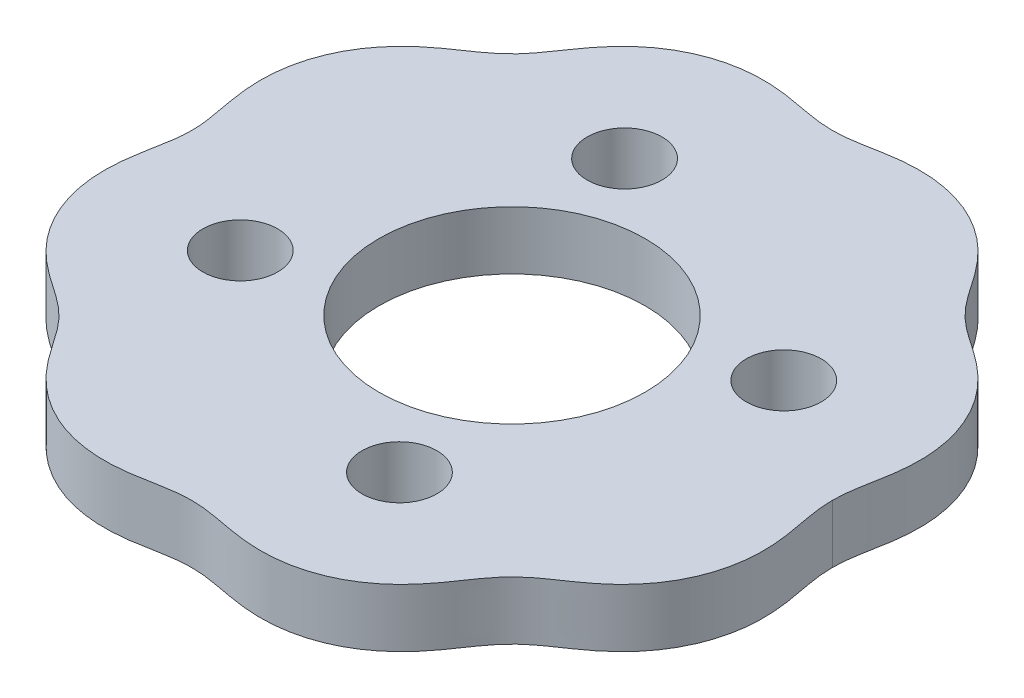
ISO-10303-21;
HEADER;
FILE_DESCRIPTION(('STEP AP214'),'2;1');
FILE_NAME('part.step','',(''),(''),'','','');
FILE_SCHEMA(('AUTOMOTIVE_DESIGN { 1 0 10303 214 1 1 1 1 }'));
ENDSEC;
DATA;
#1=APPLICATION_CONTEXT('core data for automotive mechanical design processes');
#2=APPLICATION_PROTOCOL_DEFINITION('international standard','automotive_design',2000,#1);
#3=PRODUCT_CONTEXT('',#1,'mechanical');
#4=PRODUCT('Part','Part','',(#3));
#5=PRODUCT_RELATED_PRODUCT_CATEGORY('part','',(#4));
#6=PRODUCT_DEFINITION_FORMATION('','',#4);
#7=PRODUCT_DEFINITION_CONTEXT('part definition',#1,'design');
#8=PRODUCT_DEFINITION('design','',#6,#7);
#9=PRODUCT_DEFINITION_SHAPE('','',#8);
#10=(LENGTH_UNIT() NAMED_UNIT(*) SI_UNIT(.MILLI.,.METRE.));
#11=(NAMED_UNIT(*) PLANE_ANGLE_UNIT() SI_UNIT($,.RADIAN.));
#12=(NAMED_UNIT(*) SI_UNIT($,.STERADIAN.) SOLID_ANGLE_UNIT());
#13=UNCERTAINTY_MEASURE_WITH_UNIT(LENGTH_MEASURE(1.E-05),#10,'distance_accuracy_value','');
#14=(GEOMETRIC_REPRESENTATION_CONTEXT(3) GLOBAL_UNCERTAINTY_ASSIGNED_CONTEXT((#13)) GLOBAL_UNIT_ASSIGNED_CONTEXT((#10,
#11,#12)) REPRESENTATION_CONTEXT('',''));
#15=CARTESIAN_POINT('',(0.,0.,0.));
#16=DIRECTION('',(0.,0.,1.));
#17=DIRECTION('',(1.,0.,0.));
#18=AXIS2_PLACEMENT_3D('',#15,#16,#17);
#19=CARTESIAN_POINT('',(38.5000019324491,7.,1.14099471515937E-11));
#20=CARTESIAN_POINT('',(38.4999949302389,7.,0.133038025414113));
#21=CARTESIAN_POINT('',(38.5043031681863,7.,0.465241084259243));
#22=CARTESIAN_POINT('',(38.5285272126738,7.,0.995915147057725));
#23=CARTESIAN_POINT('',(38.5972990036719,7.,1.72358155813141));
#24=CARTESIAN_POINT('',(38.7139543733227,7.,2.55647340188548));
#25=CARTESIAN_POINT('',(38.8656402849835,7.,3.42900023170654));
#26=CARTESIAN_POINT('',(39.0391822681178,7.,4.34247613603289));
#27=CARTESIAN_POINT('',(39.2165693288508,7.,5.30060109655928));
#28=CARTESIAN_POINT('',(39.3735068493325,7.,6.26232921880353));
#29=CARTESIAN_POINT('',(39.4980723718757,7.,7.22893747483395));
#30=CARTESIAN_POINT('',(39.6026794154683,7.,8.4427814490737));
#31=CARTESIAN_POINT('',(39.6384010851292,7.,10.0804988632723));
#32=CARTESIAN_POINT('',(39.4713431710599,7.,12.1348703910712));
#33=CARTESIAN_POINT('',(38.9177233658717,7.,14.5566631148558));
#34=CARTESIAN_POINT('',(37.9168742012955,7.,17.021348244654));
#35=CARTESIAN_POINT('',(36.6318803275373,7.,19.132177597851));
#36=CARTESIAN_POINT('',(35.1812554593009,7.,20.8901682691501));
#37=CARTESIAN_POINT('',(33.6686410116918,7.,22.3296155023299));
#38=CARTESIAN_POINT('',(32.1774646795737,7.,23.5049182739017));
#39=CARTESIAN_POINT('',(30.6767757172432,7.,24.536372270076));
#40=CARTESIAN_POINT('',(29.230318996941,7.,25.5119313646092));
#41=CARTESIAN_POINT('',(27.9082008530609,7.,26.5341513255084));
#42=CARTESIAN_POINT('',(26.7634346900469,7.,27.6480788865837));
#43=CARTESIAN_POINT('',(25.7050450653617,7.,28.9579021705699));
#44=CARTESIAN_POINT('',(24.7072609322575,7.,30.4189540053425));
#45=CARTESIAN_POINT('',(23.6657110773868,7.,31.9562103154773));
#46=CARTESIAN_POINT('',(22.4770763244881,7.,33.4983810963376));
#47=CARTESIAN_POINT('',(21.0292997450761,7.,35.0529468409415));
#48=CARTESIAN_POINT('',(19.266977519887,7.,36.5366609539476));
#49=CARTESIAN_POINT('',(17.1579578291745,7.,37.8471706501859));
#50=CARTESIAN_POINT('',(14.7024260646121,7.,38.8712990831224));
#51=CARTESIAN_POINT('',(11.8140839437548,7.,39.5589761228699));
#52=CARTESIAN_POINT('',(9.01989124384448,7.,39.7053354707974));
#53=CARTESIAN_POINT('',(6.42331017796858,7.,39.436329760356));
#54=CARTESIAN_POINT('',(4.13591503995918,7.,38.9992791147834));
#55=CARTESIAN_POINT('',(2.41950170808858,7.,38.6731868754648));
#56=CARTESIAN_POINT('',(0.778249625752859,7.,38.4851607428358));
#57=CARTESIAN_POINT('',(-0.77822635019066,7.,38.485379818334));
#58=CARTESIAN_POINT('',(-2.41958083804711,7.,38.6728897937332));
#59=CARTESIAN_POINT('',(-4.13574282942935,7.,38.9997474050494));
#60=CARTESIAN_POINT('',(-5.94699665356951,7.,39.3446472278609));
#61=CARTESIAN_POINT('',(-7.87516875368622,7.,39.5873622999685));
#62=CARTESIAN_POINT('',(-9.9954202984069,7.,39.6537177552512));
#63=CARTESIAN_POINT('',(-12.2880964742773,7.,39.4465622904477));
#64=CARTESIAN_POINT('',(-15.348952193081,7.,38.7167513415746));
#65=CARTESIAN_POINT('',(-18.2042574078666,7.,37.3449126939198));
#66=CARTESIAN_POINT('',(-20.5778027291725,7.,35.5385713671042));
#67=CARTESIAN_POINT('',(-22.476801362738,7.,33.4982596019561));
#68=CARTESIAN_POINT('',(-23.6659124996429,7.,31.9562973465658));
#69=CARTESIAN_POINT('',(-24.7071377322896,7.,30.4189011452566));
#70=CARTESIAN_POINT('',(-25.7051094410761,7.,28.9579297269296));
#71=CARTESIAN_POINT('',(-26.7633980304978,7.,27.6480632076652));
#72=CARTESIAN_POINT('',(-27.9082236941974,7.,26.5341610875773));
#73=CARTESIAN_POINT('',(-29.2303024165384,7.,25.5119242869971));
#74=CARTESIAN_POINT('',(-30.6767861298032,7.,24.5363766987017));
#75=CARTESIAN_POINT('',(-32.177458812035,7.,23.5049158043355));
#76=CARTESIAN_POINT('',(-33.6686436278212,7.,22.3296165653388));
#77=CARTESIAN_POINT('',(-35.1812539463559,7.,20.8901677059657));
#78=CARTESIAN_POINT('',(-36.6318813013864,7.,19.1321778776211));
#79=CARTESIAN_POINT('',(-37.9168735330831,7.,17.0213481816824));
#80=CARTESIAN_POINT('',(-38.9177238732021,7.,14.5566629755182));
#81=CARTESIAN_POINT('',(-39.4713427113459,7.,12.1348707921653));
#82=CARTESIAN_POINT('',(-39.6384015469852,7.,10.0804981180203));
#83=CARTESIAN_POINT('',(-39.6026788440248,7.,8.44278272403595));
#84=CARTESIAN_POINT('',(-39.4980734444324,7.,7.22893471621408));
#85=CARTESIAN_POINT('',(-39.3890755241485,7.,6.38316066670745));
#86=CARTESIAN_POINT('',(-39.2754229459037,7.,5.66124394496786));
#87=CARTESIAN_POINT('',(-39.1709442191014,7.,5.06129436889857));
#88=CARTESIAN_POINT('',(-39.0832490283548,7.,4.58207445934484));
#89=CARTESIAN_POINT('',(-38.993442330199,7.,4.10325655359451));
#90=CARTESIAN_POINT('',(-38.9038039602455,7.,3.62438174249061));
#91=CARTESIAN_POINT('',(-38.8030342659567,7.,3.06898404160444));
#92=CARTESIAN_POINT('',(-38.6970690359578,7.,2.43581568673759));
#93=CARTESIAN_POINT('',(-38.5972934224745,7.,1.72360163046584));
#94=CARTESIAN_POINT('',(-38.5285296393682,7.,0.995905984205315));
#95=CARTESIAN_POINT('',(-38.5043032036456,7.,0.465240188413781));
#96=CARTESIAN_POINT('',(-38.4999945667622,7.,0.133038294666439));
#97=CARTESIAN_POINT('',(-38.5000015648783,7.,2.52726963976494E-10));
#98=B_SPLINE_CURVE_WITH_KNOTS('',4,(#19,#20,#21,#22,#23,#24,#25,#26,#27,#28,#29,#30,#31,#32,#33,
#34,#35,#36,#37,#38,#39,#40,#41,#42,#43,#44,#45,#46,#47,#48,#49,#50,#51,#52,#53,#54,#55,#56,#57,
#58,#59,#60,#61,#62,#63,#64,#65,#66,#67,#68,#69,#70,#71,#72,#73,#74,#75,#76,#77,#78,#79,#80,#81,
#82,#83,#84,#85,#86,#87,#88,#89,#90,#91,#92,#93,#94,#95,#96,#97),.UNSPECIFIED.,.F.,.F.,(5,1,1,1,
1,1,1,1,1,1,1,1,1,1,1,1,1,1,1,1,1,1,1,1,1,1,1,1,1,1,1,1,1,1,1,1,1,1,1,1,1,1,1,1,1,1,1,1,1,1,1,1,
1,1,1,1,1,1,1,1,1,1,1,1,1,1,1,1,1,1,1,1,1,1,1,5),(0.102276963857903,0.105556816016901,
0.110467405471136,0.11537799492537,0.120288584379605,0.126295596961497,0.13230260954339,
0.138309622125283,0.144316634707176,0.150323647289068,0.156330659870961,0.168344685034746,
0.184673889348216,0.201003093661685,0.21733238066542,0.233661667669155,0.2453538271368,
0.257045986604444,0.268738146072088,0.280430305539732,0.290251571619334,0.300072837698936,
0.309894103778537,0.319715369858139,0.33170549697707,0.343695624096001,0.355685751214931,
0.367675878333862,0.384005121783335,0.400334365232808,0.416663644086723,0.432992922940639,
0.45692542169988,0.468891671079501,0.480857920459121,0.490428960229558,0.499999999999995,
0.509571039770432,0.519142079540869,0.531108328920492,0.543074578300115,0.555040827679738,
0.567007077059361,0.583336355913278,0.599665634767195,0.632324121666144,0.644314248785076,
0.656304375904009,0.668294503022941,0.680284630141874,0.690105896221477,0.69992716230108,
0.709748428380683,0.719569694460286,0.73126185392793,0.742954013395573,0.754646172863216,
0.76633833233086,0.782667619334596,0.798996906338332,0.815326110651802,0.831655314965273,
0.843669340129061,0.849676352710956,0.85568336529285,0.861690377874745,0.864693884165692,
0.867697390456639,0.870700896747587,0.873704403038534,0.876707909329481,0.879711415620428,
0.884622005074659,0.88953259452889,0.89444318398312,0.897723044283166),.UNSPECIFIED.);
#99=DIRECTION('',(0.,-1.,0.));
#100=VECTOR('',#99,1.);
#101=SURFACE_OF_LINEAR_EXTRUSION('',#98,#100);
#102=CARTESIAN_POINT('',(38.5000019324491,0.,1.14099471515937E-11));
#103=CARTESIAN_POINT('',(38.4999949302389,0.,0.133038025414113));
#104=CARTESIAN_POINT('',(38.5043031681863,0.,0.465241084259243));
#105=CARTESIAN_POINT('',(38.5285272126738,0.,0.995915147057725));
#106=CARTESIAN_POINT('',(38.5972990036719,0.,1.72358155813141));
#107=CARTESIAN_POINT('',(38.7139543733227,0.,2.55647340188548));
#108=CARTESIAN_POINT('',(38.8656402849835,0.,3.42900023170654));
#109=CARTESIAN_POINT('',(39.0391822681178,0.,4.34247613603289));
#110=CARTESIAN_POINT('',(39.2165693288508,0.,5.30060109655928));
#111=CARTESIAN_POINT('',(39.3735068493325,0.,6.26232921880353));
#112=CARTESIAN_POINT('',(39.4980723718757,0.,7.22893747483395));
#113=CARTESIAN_POINT('',(39.6026794154683,0.,8.4427814490737));
#114=CARTESIAN_POINT('',(39.6384010851292,0.,10.0804988632723));
#115=CARTESIAN_POINT('',(39.4713431710599,0.,12.1348703910712));
#116=CARTESIAN_POINT('',(38.9177233658717,0.,14.5566631148558));
#117=CARTESIAN_POINT('',(37.9168742012955,0.,17.021348244654));
#118=CARTESIAN_POINT('',(36.6318803275373,0.,19.132177597851));
#119=CARTESIAN_POINT('',(35.1812554593009,0.,20.8901682691501));
#120=CARTESIAN_POINT('',(33.6686410116918,0.,22.3296155023299));
#121=CARTESIAN_POINT('',(32.1774646795737,0.,23.5049182739017));
#122=CARTESIAN_POINT('',(30.6767757172432,0.,24.536372270076));
#123=CARTESIAN_POINT('',(29.230318996941,0.,25.5119313646092));
#124=CARTESIAN_POINT('',(27.9082008530609,0.,26.5341513255084));
#125=CARTESIAN_POINT('',(26.7634346900469,0.,27.6480788865837));
#126=CARTESIAN_POINT('',(25.7050450653617,0.,28.9579021705699));
#127=CARTESIAN_POINT('',(24.7072609322575,0.,30.4189540053425));
#128=CARTESIAN_POINT('',(23.6657110773868,0.,31.9562103154773));
#129=CARTESIAN_POINT('',(22.4770763244881,0.,33.4983810963376));
#130=CARTESIAN_POINT('',(21.0292997450761,0.,35.0529468409415));
#131=CARTESIAN_POINT('',(19.266977519887,0.,36.5366609539476));
#132=CARTESIAN_POINT('',(17.1579578291745,0.,37.8471706501859));
#133=CARTESIAN_POINT('',(14.7024260646121,0.,38.8712990831224));
#134=CARTESIAN_POINT('',(11.8140839437548,0.,39.5589761228699));
#135=CARTESIAN_POINT('',(9.01989124384448,0.,39.7053354707974));
#136=CARTESIAN_POINT('',(6.42331017796858,0.,39.436329760356));
#137=CARTESIAN_POINT('',(4.13591503995918,0.,38.9992791147834));
#138=CARTESIAN_POINT('',(2.41950170808858,0.,38.6731868754648));
#139=CARTESIAN_POINT('',(0.778249625752859,0.,38.4851607428358));
#140=CARTESIAN_POINT('',(-0.77822635019066,0.,38.485379818334));
#141=CARTESIAN_POINT('',(-2.41958083804711,0.,38.6728897937332));
#142=CARTESIAN_POINT('',(-4.13574282942935,0.,38.9997474050494));
#143=CARTESIAN_POINT('',(-5.94699665356951,0.,39.3446472278609));
#144=CARTESIAN_POINT('',(-7.87516875368622,0.,39.5873622999685));
#145=CARTESIAN_POINT('',(-9.9954202984069,0.,39.6537177552512));
#146=CARTESIAN_POINT('',(-12.2880964742773,0.,39.4465622904477));
#147=CARTESIAN_POINT('',(-15.348952193081,0.,38.7167513415746));
#148=CARTESIAN_POINT('',(-18.2042574078666,0.,37.3449126939198));
#149=CARTESIAN_POINT('',(-20.5778027291725,0.,35.5385713671042));
#150=CARTESIAN_POINT('',(-22.476801362738,0.,33.4982596019561));
#151=CARTESIAN_POINT('',(-23.6659124996429,0.,31.9562973465658));
#152=CARTESIAN_POINT('',(-24.7071377322896,0.,30.4189011452566));
#153=CARTESIAN_POINT('',(-25.7051094410761,0.,28.9579297269296));
#154=CARTESIAN_POINT('',(-26.7633980304978,0.,27.6480632076652));
#155=CARTESIAN_POINT('',(-27.9082236941974,0.,26.5341610875773));
#156=CARTESIAN_POINT('',(-29.2303024165384,0.,25.5119242869971));
#157=CARTESIAN_POINT('',(-30.6767861298032,0.,24.5363766987017));
#158=CARTESIAN_POINT('',(-32.177458812035,0.,23.5049158043355));
#159=CARTESIAN_POINT('',(-33.6686436278212,0.,22.3296165653388));
#160=CARTESIAN_POINT('',(-35.1812539463559,0.,20.8901677059657));
#161=CARTESIAN_POINT('',(-36.6318813013864,0.,19.1321778776211));
#162=CARTESIAN_POINT('',(-37.9168735330831,0.,17.0213481816824));
#163=CARTESIAN_POINT('',(-38.9177238732021,0.,14.5566629755182));
#164=CARTESIAN_POINT('',(-39.4713427113459,0.,12.1348707921653));
#165=CARTESIAN_POINT('',(-39.6384015469852,0.,10.0804981180203));
#166=CARTESIAN_POINT('',(-39.6026788440248,0.,8.44278272403595));
#167=CARTESIAN_POINT('',(-39.4980734444324,0.,7.22893471621408));
#168=CARTESIAN_POINT('',(-39.3890755241485,0.,6.38316066670745));
#169=CARTESIAN_POINT('',(-39.2754229459037,0.,5.66124394496786));
#170=CARTESIAN_POINT('',(-39.1709442191014,0.,5.06129436889857));
#171=CARTESIAN_POINT('',(-39.0832490283548,0.,4.58207445934484));
#172=CARTESIAN_POINT('',(-38.993442330199,0.,4.10325655359451));
#173=CARTESIAN_POINT('',(-38.9038039602455,0.,3.62438174249061));
#174=CARTESIAN_POINT('',(-38.8030342659567,0.,3.06898404160444));
#175=CARTESIAN_POINT('',(-38.6970690359578,0.,2.43581568673759));
#176=CARTESIAN_POINT('',(-38.5972934224745,0.,1.72360163046584));
#177=CARTESIAN_POINT('',(-38.5285296393682,0.,0.995905984205315));
#178=CARTESIAN_POINT('',(-38.5043032036456,0.,0.465240188413781));
#179=CARTESIAN_POINT('',(-38.4999945667622,0.,0.133038294666439));
#180=CARTESIAN_POINT('',(-38.5000015648783,0.,2.52726963976494E-10));
#181=B_SPLINE_CURVE_WITH_KNOTS('',4,(#102,#103,#104,#105,#106,#107,#108,#109,#110,#111,#112,
#113,#114,#115,#116,#117,#118,#119,#120,#121,#122,#123,#124,#125,#126,#127,#128,#129,#130,#131,
#132,#133,#134,#135,#136,#137,#138,#139,#140,#141,#142,#143,#144,#145,#146,#147,#148,#149,#150,
#151,#152,#153,#154,#155,#156,#157,#158,#159,#160,#161,#162,#163,#164,#165,#166,#167,#168,#169,
#170,#171,#172,#173,#174,#175,#176,#177,#178,#179,#180),.UNSPECIFIED.,.F.,.F.,(5,1,1,1,1,1,1,1,
1,1,1,1,1,1,1,1,1,1,1,1,1,1,1,1,1,1,1,1,1,1,1,1,1,1,1,1,1,1,1,1,1,1,1,1,1,1,1,1,1,1,1,1,1,1,1,1,
1,1,1,1,1,1,1,1,1,1,1,1,1,1,1,1,1,1,1,5),(0.102276963857903,0.105556816016901,0.110467405471136,
0.11537799492537,0.120288584379605,0.126295596961497,0.13230260954339,0.138309622125283,
0.144316634707176,0.150323647289068,0.156330659870961,0.168344685034746,0.184673889348216,
0.201003093661685,0.21733238066542,0.233661667669155,0.2453538271368,0.257045986604444,
0.268738146072088,0.280430305539732,0.290251571619334,0.300072837698936,0.309894103778537,
0.319715369858139,0.33170549697707,0.343695624096001,0.355685751214931,0.367675878333862,
0.384005121783335,0.400334365232808,0.416663644086723,0.432992922940639,0.45692542169988,
0.468891671079501,0.480857920459121,0.490428960229558,0.499999999999995,0.509571039770432,
0.519142079540869,0.531108328920492,0.543074578300115,0.555040827679738,0.567007077059361,
0.583336355913278,0.599665634767195,0.632324121666144,0.644314248785076,0.656304375904009,
0.668294503022941,0.680284630141874,0.690105896221477,0.69992716230108,0.709748428380683,
0.719569694460286,0.73126185392793,0.742954013395573,0.754646172863216,0.76633833233086,
0.782667619334596,0.798996906338332,0.815326110651802,0.831655314965273,0.843669340129061,
0.849676352710956,0.85568336529285,0.861690377874745,0.864693884165692,0.867697390456639,
0.870700896747587,0.873704403038534,0.876707909329481,0.879711415620428,0.884622005074659,
0.88953259452889,0.89444318398312,0.897723044283166),.UNSPECIFIED.);
#182=CARTESIAN_POINT('',(38.5000019324491,0.,0.));
#183=VERTEX_POINT('',#182);
#184=CARTESIAN_POINT('',(-38.5000015648783,0.,0.));
#185=VERTEX_POINT('',#184);
#186=EDGE_CURVE('E65',#183,#185,#181,.T.);
#187=ORIENTED_EDGE('',*,*,#186,.F.);
#188=DIRECTION('',(0.,-1.,0.));
#189=VECTOR('',#188,1.);
#190=CARTESIAN_POINT('',(38.5000019324491,7.,0.));
#191=LINE('',#190,#189);
#192=CARTESIAN_POINT('',(38.5000019324491,7.,0.));
#193=VERTEX_POINT('',#192);
#194=EDGE_CURVE('E11',#193,#183,#191,.T.);
#195=ORIENTED_EDGE('',*,*,#194,.F.);
#196=CARTESIAN_POINT('',(-38.5000015648783,7.,0.));
#197=VERTEX_POINT('',#196);
#198=EDGE_CURVE('E66',#193,#197,#98,.T.);
#199=ORIENTED_EDGE('',*,*,#198,.T.);
#200=DIRECTION('',(0.,-1.,0.));
#201=VECTOR('',#200,1.);
#202=CARTESIAN_POINT('',(-38.5000015648783,7.,0.));
#203=LINE('',#202,#201);
#204=EDGE_CURVE('E37',#197,#185,#203,.T.);
#205=ORIENTED_EDGE('',*,*,#204,.T.);
#206=EDGE_LOOP('',(#187,#195,#199,#205));
#207=FACE_BOUND('',#206,.T.);
#208=ADVANCED_FACE('F33',(#207),#101,.T.);
#209=CARTESIAN_POINT('',(38.5000019324491,7.,0.));
#210=CARTESIAN_POINT('',(38.4999949302359,7.,-0.133038025468732));
#211=CARTESIAN_POINT('',(38.5043031681788,7.,-0.465241084380064));
#212=CARTESIAN_POINT('',(38.5285272126645,7.,-0.995915147244723));
#213=CARTESIAN_POINT('',(38.5972990036665,7.,-1.72358155838438));
#214=CARTESIAN_POINT('',(38.7139543733147,7.,-2.55647340213882));
#215=CARTESIAN_POINT('',(38.8656402849727,7.,-3.42900023196035));
#216=CARTESIAN_POINT('',(39.0391822681042,7.,-4.34247613628724));
#217=CARTESIAN_POINT('',(39.2165693288341,7.,-5.30060109681419));
#218=CARTESIAN_POINT('',(39.3735068493129,7.,-6.26232921905893));
#219=CARTESIAN_POINT('',(39.498072371853,7.,-7.22893747508974));
#220=CARTESIAN_POINT('',(39.6026794154419,7.,-8.44278144932982));
#221=CARTESIAN_POINT('',(39.6384010850976,7.,-10.0804988635285));
#222=CARTESIAN_POINT('',(39.4713431710219,7.,-12.1348703913269));
#223=CARTESIAN_POINT('',(38.9177233658261,7.,-14.5566631151097));
#224=CARTESIAN_POINT('',(37.9168742012422,7.,-17.0213482449048));
#225=CARTESIAN_POINT('',(36.6318803274773,7.,-19.1321775980978));
#226=CARTESIAN_POINT('',(35.1812554592354,7.,-20.8901682693924));
#227=CARTESIAN_POINT('',(33.6686410116219,7.,-22.3296155025674));
#228=CARTESIAN_POINT('',(32.1774646795,7.,-23.5049182741345));
#229=CARTESIAN_POINT('',(30.6767757171663,7.,-24.5363722703041));
#230=CARTESIAN_POINT('',(29.230318996861,7.,-25.5119313648328));
#231=CARTESIAN_POINT('',(27.9082008529778,7.,-26.5341513257278));
#232=CARTESIAN_POINT('',(26.7634346899602,7.,-27.6480788867996));
#233=CARTESIAN_POINT('',(25.7050450652709,7.,-28.9579021707824));
#234=CARTESIAN_POINT('',(24.7072609321621,7.,-30.4189540055519));
#235=CARTESIAN_POINT('',(23.6657110772866,7.,-31.9562103156834));
#236=CARTESIAN_POINT('',(22.4770763243831,7.,-33.4983810965401));
#237=CARTESIAN_POINT('',(21.0292997449663,7.,-35.0529468411394));
#238=CARTESIAN_POINT('',(19.2669775197725,7.,-36.5366609541399));
#239=CARTESIAN_POINT('',(17.1579578290559,7.,-37.8471706503717));
#240=CARTESIAN_POINT('',(14.7024260644903,7.,-38.8712990833005));
#241=CARTESIAN_POINT('',(11.8140839436308,7.,-39.5589761230389));
#242=CARTESIAN_POINT('',(9.01989124372002,7.,-39.7053354709576));
#243=CARTESIAN_POINT('',(6.42331017784497,7.,-39.4363297605082));
#244=CARTESIAN_POINT('',(4.13591503983694,7.,-38.9992791149284));
#245=CARTESIAN_POINT('',(2.41950170796736,7.,-38.6731868756044));
#246=CARTESIAN_POINT('',(0.778249625632229,7.,-38.4851607429703));
#247=CARTESIAN_POINT('',(-0.778226350311291,7.,-38.4853798184635));
#248=CARTESIAN_POINT('',(-2.41958083816833,7.,-38.6728897938576));
#249=CARTESIAN_POINT('',(-4.13574282955159,7.,-38.9997474051684));
#250=CARTESIAN_POINT('',(-5.94699665369283,7.,-39.3446472279742));
#251=CARTESIAN_POINT('',(-7.8751687538103,7.,-39.5873623000758));
#252=CARTESIAN_POINT('',(-9.99542029853118,7.,-39.6537177553519));
#253=CARTESIAN_POINT('',(-12.2880964744009,7.,-39.4465622905412));
#254=CARTESIAN_POINT('',(-15.3489521932024,7.,-38.7167513416584));
#255=CARTESIAN_POINT('',(-18.2042574079837,7.,-37.3449126939948));
#256=CARTESIAN_POINT('',(-20.5778027292839,7.,-35.5385713671717));
#257=CARTESIAN_POINT('',(-22.476801362843,7.,-33.4982596020176));
#258=CARTESIAN_POINT('',(-23.6659124997431,7.,-31.9562973466237));
#259=CARTESIAN_POINT('',(-24.7071377323849,7.,-30.4189011453112));
#260=CARTESIAN_POINT('',(-25.7051094411668,7.,-28.957929726981));
#261=CARTESIAN_POINT('',(-26.7633980305845,7.,-27.6480632077134));
#262=CARTESIAN_POINT('',(-27.9082236942806,7.,-26.5341610876219));
#263=CARTESIAN_POINT('',(-29.2303024166183,7.,-25.5119242870375));
#264=CARTESIAN_POINT('',(-30.6767861298801,7.,-24.5363766987376));
#265=CARTESIAN_POINT('',(-32.1774588121087,7.,-23.5049158043667));
#266=CARTESIAN_POINT('',(-33.6686436278912,7.,-22.3296165653653));
#267=CARTESIAN_POINT('',(-35.1812539464213,7.,-20.8901677059875));
#268=CARTESIAN_POINT('',(-36.6318813014464,7.,-19.1321778776383));
#269=CARTESIAN_POINT('',(-37.9168735331364,7.,-17.0213481816955));
#270=CARTESIAN_POINT('',(-38.9177238732477,7.,-14.5566629755282));
#271=CARTESIAN_POINT('',(-39.4713427113839,7.,-12.1348707921736));
#272=CARTESIAN_POINT('',(-39.6384015470168,7.,-10.0804981180281));
#273=CARTESIAN_POINT('',(-39.6026788440512,7.,-8.44278272404384));
#274=CARTESIAN_POINT('',(-39.498073444455,7.,-7.2289347162223));
#275=CARTESIAN_POINT('',(-39.3890755241685,7.,-6.38316066671601));
#276=CARTESIAN_POINT('',(-39.2754229459215,7.,-5.66124394497678));
#277=CARTESIAN_POINT('',(-39.1709442191173,7.,-5.06129436890781));
#278=CARTESIAN_POINT('',(-39.0832490283692,7.,-4.58207445935436));
#279=CARTESIAN_POINT('',(-38.9934423302119,7.,-4.10325655360431));
#280=CARTESIAN_POINT('',(-38.9038039602568,7.,-3.6243817425007));
#281=CARTESIAN_POINT('',(-38.8030342659663,7.,-3.06898404161483));
#282=CARTESIAN_POINT('',(-38.6970690359654,7.,-2.43581568674832));
#283=CARTESIAN_POINT('',(-38.5972934224799,7.,-1.72360163047688));
#284=CARTESIAN_POINT('',(-38.5285296393651,7.,-0.995905984150815));
#285=CARTESIAN_POINT('',(-38.504303203641,7.,-0.465240188293262));
#286=CARTESIAN_POINT('',(-38.4999945667601,7.,-0.133038294479743));
#287=CARTESIAN_POINT('',(-38.5000015648783,7.,0.));
#288=B_SPLINE_CURVE_WITH_KNOTS('',4,(#209,#210,#211,#212,#213,#214,#215,#216,#217,#218,#219,
#220,#221,#222,#223,#224,#225,#226,#227,#228,#229,#230,#231,#232,#233,#234,#235,#236,#237,#238,
#239,#240,#241,#242,#243,#244,#245,#246,#247,#248,#249,#250,#251,#252,#253,#254,#255,#256,#257,
#258,#259,#260,#261,#262,#263,#264,#265,#266,#267,#268,#269,#270,#271,#272,#273,#274,#275,#276,
#277,#278,#279,#280,#281,#282,#283,#284,#285,#286,#287),.UNSPECIFIED.,.F.,.F.,(5,1,1,1,1,1,1,1,
1,1,1,1,1,1,1,1,1,1,1,1,1,1,1,1,1,1,1,1,1,1,1,1,1,1,1,1,1,1,1,1,1,1,1,1,1,1,1,1,1,1,1,1,1,1,1,1,
1,1,1,1,1,1,1,1,1,1,1,1,1,1,1,1,1,1,1,5),(0.102276963856275,0.105556816016901,0.110467405471136,
0.11537799492537,0.120288584379605,0.126295596961497,0.13230260954339,0.138309622125283,
0.144316634707176,0.150323647289068,0.156330659870961,0.168344685034746,0.184673889348216,
0.201003093661685,0.21733238066542,0.233661667669155,0.2453538271368,0.257045986604444,
0.268738146072088,0.280430305539732,0.290251571619334,0.300072837698936,0.309894103778537,
0.319715369858139,0.33170549697707,0.343695624096001,0.355685751214931,0.367675878333862,
0.384005121783335,0.400334365232808,0.416663644086723,0.432992922940639,0.45692542169988,
0.468891671079501,0.480857920459121,0.490428960229558,0.499999999999995,0.509571039770432,
0.519142079540869,0.531108328920492,0.543074578300115,0.555040827679738,0.567007077059361,
0.583336355913278,0.599665634767195,0.632324121666144,0.644314248785076,0.656304375904009,
0.668294503022941,0.680284630141874,0.690105896221477,0.69992716230108,0.709748428380683,
0.719569694460286,0.73126185392793,0.742954013395573,0.754646172863216,0.76633833233086,
0.782667619334596,0.798996906338332,0.815326110651802,0.831655314965273,0.843669340129061,
0.849676352710956,0.85568336529285,0.861690377874745,0.864693884165692,0.867697390456639,
0.870700896747587,0.873704403038534,0.876707909329481,0.879711415620428,0.884622005074659,
0.88953259452889,0.89444318398312,0.897723044284794),.UNSPECIFIED.);
#289=DIRECTION('',(0.,-1.,0.));
#290=VECTOR('',#289,1.);
#291=SURFACE_OF_LINEAR_EXTRUSION('',#288,#290);
#292=CARTESIAN_POINT('',(38.5000019324491,0.,0.));
#293=CARTESIAN_POINT('',(38.4999949302359,0.,-0.133038025468732));
#294=CARTESIAN_POINT('',(38.5043031681788,0.,-0.465241084380064));
#295=CARTESIAN_POINT('',(38.5285272126645,0.,-0.995915147244723));
#296=CARTESIAN_POINT('',(38.5972990036665,0.,-1.72358155838438));
#297=CARTESIAN_POINT('',(38.7139543733147,0.,-2.55647340213882));
#298=CARTESIAN_POINT('',(38.8656402849727,0.,-3.42900023196035));
#299=CARTESIAN_POINT('',(39.0391822681042,0.,-4.34247613628724));
#300=CARTESIAN_POINT('',(39.2165693288341,0.,-5.30060109681419));
#301=CARTESIAN_POINT('',(39.3735068493129,0.,-6.26232921905893));
#302=CARTESIAN_POINT('',(39.498072371853,0.,-7.22893747508974));
#303=CARTESIAN_POINT('',(39.6026794154419,0.,-8.44278144932982));
#304=CARTESIAN_POINT('',(39.6384010850976,0.,-10.0804988635285));
#305=CARTESIAN_POINT('',(39.4713431710219,0.,-12.1348703913269));
#306=CARTESIAN_POINT('',(38.9177233658261,0.,-14.5566631151097));
#307=CARTESIAN_POINT('',(37.9168742012422,0.,-17.0213482449048));
#308=CARTESIAN_POINT('',(36.6318803274773,0.,-19.1321775980978));
#309=CARTESIAN_POINT('',(35.1812554592354,0.,-20.8901682693924));
#310=CARTESIAN_POINT('',(33.6686410116219,0.,-22.3296155025674));
#311=CARTESIAN_POINT('',(32.1774646795,0.,-23.5049182741345));
#312=CARTESIAN_POINT('',(30.6767757171663,0.,-24.5363722703041));
#313=CARTESIAN_POINT('',(29.230318996861,0.,-25.5119313648328));
#314=CARTESIAN_POINT('',(27.9082008529778,0.,-26.5341513257278));
#315=CARTESIAN_POINT('',(26.7634346899602,0.,-27.6480788867996));
#316=CARTESIAN_POINT('',(25.7050450652709,0.,-28.9579021707824));
#317=CARTESIAN_POINT('',(24.7072609321621,0.,-30.4189540055519));
#318=CARTESIAN_POINT('',(23.6657110772866,0.,-31.9562103156834));
#319=CARTESIAN_POINT('',(22.4770763243831,0.,-33.4983810965401));
#320=CARTESIAN_POINT('',(21.0292997449663,0.,-35.0529468411394));
#321=CARTESIAN_POINT('',(19.2669775197725,0.,-36.5366609541399));
#322=CARTESIAN_POINT('',(17.1579578290559,0.,-37.8471706503717));
#323=CARTESIAN_POINT('',(14.7024260644903,0.,-38.8712990833005));
#324=CARTESIAN_POINT('',(11.8140839436308,0.,-39.5589761230389));
#325=CARTESIAN_POINT('',(9.01989124372002,0.,-39.7053354709576));
#326=CARTESIAN_POINT('',(6.42331017784497,0.,-39.4363297605082));
#327=CARTESIAN_POINT('',(4.13591503983694,0.,-38.9992791149284));
#328=CARTESIAN_POINT('',(2.41950170796736,0.,-38.6731868756044));
#329=CARTESIAN_POINT('',(0.778249625632229,0.,-38.4851607429703));
#330=CARTESIAN_POINT('',(-0.778226350311291,0.,-38.4853798184635));
#331=CARTESIAN_POINT('',(-2.41958083816833,0.,-38.6728897938576));
#332=CARTESIAN_POINT('',(-4.13574282955159,0.,-38.9997474051684));
#333=CARTESIAN_POINT('',(-5.94699665369283,0.,-39.3446472279742));
#334=CARTESIAN_POINT('',(-7.8751687538103,0.,-39.5873623000758));
#335=CARTESIAN_POINT('',(-9.99542029853118,0.,-39.6537177553519));
#336=CARTESIAN_POINT('',(-12.2880964744009,0.,-39.4465622905412));
#337=CARTESIAN_POINT('',(-15.3489521932024,0.,-38.7167513416584));
#338=CARTESIAN_POINT('',(-18.2042574079837,0.,-37.3449126939948));
#339=CARTESIAN_POINT('',(-20.5778027292839,0.,-35.5385713671717));
#340=CARTESIAN_POINT('',(-22.476801362843,0.,-33.4982596020176));
#341=CARTESIAN_POINT('',(-23.6659124997431,0.,-31.9562973466237));
#342=CARTESIAN_POINT('',(-24.7071377323849,0.,-30.4189011453112));
#343=CARTESIAN_POINT('',(-25.7051094411668,0.,-28.957929726981));
#344=CARTESIAN_POINT('',(-26.7633980305845,0.,-27.6480632077134));
#345=CARTESIAN_POINT('',(-27.9082236942806,0.,-26.5341610876219));
#346=CARTESIAN_POINT('',(-29.2303024166183,0.,-25.5119242870375));
#347=CARTESIAN_POINT('',(-30.6767861298801,0.,-24.5363766987376));
#348=CARTESIAN_POINT('',(-32.1774588121087,0.,-23.5049158043667));
#349=CARTESIAN_POINT('',(-33.6686436278912,0.,-22.3296165653653));
#350=CARTESIAN_POINT('',(-35.1812539464213,0.,-20.8901677059875));
#351=CARTESIAN_POINT('',(-36.6318813014464,0.,-19.1321778776383));
#352=CARTESIAN_POINT('',(-37.9168735331364,0.,-17.0213481816955));
#353=CARTESIAN_POINT('',(-38.9177238732477,0.,-14.5566629755282));
#354=CARTESIAN_POINT('',(-39.4713427113839,0.,-12.1348707921736));
#355=CARTESIAN_POINT('',(-39.6384015470168,0.,-10.0804981180281));
#356=CARTESIAN_POINT('',(-39.6026788440512,0.,-8.44278272404384));
#357=CARTESIAN_POINT('',(-39.498073444455,0.,-7.2289347162223));
#358=CARTESIAN_POINT('',(-39.3890755241685,0.,-6.38316066671601));
#359=CARTESIAN_POINT('',(-39.2754229459215,0.,-5.66124394497678));
#360=CARTESIAN_POINT('',(-39.1709442191173,0.,-5.06129436890781));
#361=CARTESIAN_POINT('',(-39.0832490283692,0.,-4.58207445935436));
#362=CARTESIAN_POINT('',(-38.9934423302119,0.,-4.10325655360431));
#363=CARTESIAN_POINT('',(-38.9038039602568,0.,-3.6243817425007));
#364=CARTESIAN_POINT('',(-38.8030342659663,0.,-3.06898404161483));
#365=CARTESIAN_POINT('',(-38.6970690359654,0.,-2.43581568674832));
#366=CARTESIAN_POINT('',(-38.5972934224799,0.,-1.72360163047688));
#367=CARTESIAN_POINT('',(-38.5285296393651,0.,-0.995905984150815));
#368=CARTESIAN_POINT('',(-38.504303203641,0.,-0.465240188293262));
#369=CARTESIAN_POINT('',(-38.4999945667601,0.,-0.133038294479743));
#370=CARTESIAN_POINT('',(-38.5000015648783,0.,0.));
#371=B_SPLINE_CURVE_WITH_KNOTS('',4,(#292,#293,#294,#295,#296,#297,#298,#299,#300,#301,#302,
#303,#304,#305,#306,#307,#308,#309,#310,#311,#312,#313,#314,#315,#316,#317,#318,#319,#320,#321,
#322,#323,#324,#325,#326,#327,#328,#329,#330,#331,#332,#333,#334,#335,#336,#337,#338,#339,#340,
#341,#342,#343,#344,#345,#346,#347,#348,#349,#350,#351,#352,#353,#354,#355,#356,#357,#358,#359,
#360,#361,#362,#363,#364,#365,#366,#367,#368,#369,#370),.UNSPECIFIED.,.F.,.F.,(5,1,1,1,1,1,1,1,
1,1,1,1,1,1,1,1,1,1,1,1,1,1,1,1,1,1,1,1,1,1,1,1,1,1,1,1,1,1,1,1,1,1,1,1,1,1,1,1,1,1,1,1,1,1,1,1,
1,1,1,1,1,1,1,1,1,1,1,1,1,1,1,1,1,1,1,5),(0.102276963856275,0.105556816016901,0.110467405471136,
0.11537799492537,0.120288584379605,0.126295596961497,0.13230260954339,0.138309622125283,
0.144316634707176,0.150323647289068,0.156330659870961,0.168344685034746,0.184673889348216,
0.201003093661685,0.21733238066542,0.233661667669155,0.2453538271368,0.257045986604444,
0.268738146072088,0.280430305539732,0.290251571619334,0.300072837698936,0.309894103778537,
0.319715369858139,0.33170549697707,0.343695624096001,0.355685751214931,0.367675878333862,
0.384005121783335,0.400334365232808,0.416663644086723,0.432992922940639,0.45692542169988,
0.468891671079501,0.480857920459121,0.490428960229558,0.499999999999995,0.509571039770432,
0.519142079540869,0.531108328920492,0.543074578300115,0.555040827679738,0.567007077059361,
0.583336355913278,0.599665634767195,0.632324121666144,0.644314248785076,0.656304375904009,
0.668294503022941,0.680284630141874,0.690105896221477,0.69992716230108,0.709748428380683,
0.719569694460286,0.73126185392793,0.742954013395573,0.754646172863216,0.76633833233086,
0.782667619334596,0.798996906338332,0.815326110651802,0.831655314965273,0.843669340129061,
0.849676352710956,0.85568336529285,0.861690377874745,0.864693884165692,0.867697390456639,
0.870700896747587,0.873704403038534,0.876707909329481,0.879711415620428,0.884622005074659,
0.88953259452889,0.89444318398312,0.897723044284794),.UNSPECIFIED.);
#372=EDGE_CURVE('E59',#183,#185,#371,.T.);
#373=ORIENTED_EDGE('',*,*,#372,.T.);
#374=ORIENTED_EDGE('',*,*,#204,.F.);
#375=EDGE_CURVE('E61',#193,#197,#288,.T.);
#376=ORIENTED_EDGE('',*,*,#375,.F.);
#377=ORIENTED_EDGE('',*,*,#194,.T.);
#378=EDGE_LOOP('',(#373,#374,#376,#377));
#379=FACE_BOUND('',#378,.T.);
#380=ADVANCED_FACE('F58',(#379),#291,.F.);
#381=CARTESIAN_POINT('',(6.96182949521583E-06,7.,38.4999962999718));
#382=DIRECTION('',(0.,-1.,0.));
#383=DIRECTION('',(0.,0.,-1.));
#384=AXIS2_PLACEMENT_3D('',#381,#382,#383);
#385=PLANE('',#384);
#386=CARTESIAN_POINT('',(23.096995346999,7.,-9.56706882700783));
#387=DIRECTION('',(0.,1.,0.));
#388=DIRECTION('',(0.,0.,1.));
#389=AXIS2_PLACEMENT_3D('',#386,#387,#388);
#390=CIRCLE('',#389,4.5);
#391=CARTESIAN_POINT('',(23.096995346999,7.,-5.06706882700783));
#392=VERTEX_POINT('',#391);
#393=EDGE_CURVE('E71',#392,#392,#390,.T.);
#394=ORIENTED_EDGE('',*,*,#393,.F.);
#395=EDGE_LOOP('',(#394));
#396=FACE_BOUND('',#395,.T.);
#397=CARTESIAN_POINT('',(-9.56706882700818,7.,-23.0969953469982));
#398=DIRECTION('',(0.,1.,0.));
#399=DIRECTION('',(0.,0.,1.));
#400=AXIS2_PLACEMENT_3D('',#397,#398,#399);
#401=CIRCLE('',#400,4.5);
#402=CARTESIAN_POINT('',(-9.56706882700818,7.,-18.5969953469982));
#403=VERTEX_POINT('',#402);
#404=EDGE_CURVE('E197',#403,#403,#401,.T.);
#405=ORIENTED_EDGE('',*,*,#404,.F.);
#406=EDGE_LOOP('',(#405));
#407=FACE_BOUND('',#406,.T.);
#408=CARTESIAN_POINT('',(-23.0969953469985,7.,9.56706882700902));
#409=DIRECTION('',(0.,1.,0.));
#410=DIRECTION('',(0.,0.,1.));
#411=AXIS2_PLACEMENT_3D('',#408,#409,#410);
#412=CIRCLE('',#411,4.5);
#413=CARTESIAN_POINT('',(-23.0969953469985,7.,14.067068827009));
#414=VERTEX_POINT('',#413);
#415=EDGE_CURVE('E191',#414,#414,#412,.T.);
#416=ORIENTED_EDGE('',*,*,#415,.F.);
#417=EDGE_LOOP('',(#416));
#418=FACE_BOUND('',#417,.T.);
#419=CARTESIAN_POINT('',(9.56706882700867,7.,23.0969953469994));
#420=DIRECTION('',(0.,1.,0.));
#421=DIRECTION('',(0.,0.,1.));
#422=AXIS2_PLACEMENT_3D('',#419,#420,#421);
#423=CIRCLE('',#422,4.5);
#424=CARTESIAN_POINT('',(9.56706882700867,7.,27.5969953469994));
#425=VERTEX_POINT('',#424);
#426=EDGE_CURVE('E190',#425,#425,#423,.T.);
#427=ORIENTED_EDGE('',*,*,#426,.F.);
#428=EDGE_LOOP('',(#427));
#429=FACE_BOUND('',#428,.T.);
#430=CARTESIAN_POINT('',(0.,7.,0.));
#431=DIRECTION('',(0.,1.,0.));
#432=DIRECTION('',(0.,0.,1.));
#433=AXIS2_PLACEMENT_3D('',#430,#431,#432);
#434=CIRCLE('',#433,16.);
#435=CARTESIAN_POINT('',(0.,7.,16.));
#436=VERTEX_POINT('',#435);
#437=EDGE_CURVE('E184',#436,#436,#434,.T.);
#438=ORIENTED_EDGE('',*,*,#437,.F.);
#439=EDGE_LOOP('',(#438));
#440=FACE_BOUND('',#439,.T.);
#441=ORIENTED_EDGE('',*,*,#198,.F.);
#442=ORIENTED_EDGE('',*,*,#375,.T.);
#443=EDGE_LOOP('',(#441,#442));
#444=FACE_BOUND('',#443,.T.);
#445=ADVANCED_FACE('F96',(#396,#407,#418,#429,#440,#444),#385,.F.);
#446=CARTESIAN_POINT('',(6.96182949521583E-06,0.,38.4999962999718));
#447=DIRECTION('',(0.,-1.,0.));
#448=DIRECTION('',(0.,0.,-1.));
#449=AXIS2_PLACEMENT_3D('',#446,#447,#448);
#450=PLANE('',#449);
#451=CARTESIAN_POINT('',(23.096995346999,0.,-9.56706882700783));
#452=DIRECTION('',(0.,1.,0.));
#453=DIRECTION('',(0.,0.,1.));
#454=AXIS2_PLACEMENT_3D('',#451,#452,#453);
#455=CIRCLE('',#454,4.5);
#456=CARTESIAN_POINT('',(23.096995346999,0.,-5.06706882700783));
#457=VERTEX_POINT('',#456);
#458=EDGE_CURVE('E68',#457,#457,#455,.T.);
#459=ORIENTED_EDGE('',*,*,#458,.T.);
#460=EDGE_LOOP('',(#459));
#461=FACE_BOUND('',#460,.T.);
#462=CARTESIAN_POINT('',(-9.56706882700818,0.,-23.0969953469982));
#463=DIRECTION('',(0.,1.,0.));
#464=DIRECTION('',(0.,0.,1.));
#465=AXIS2_PLACEMENT_3D('',#462,#463,#464);
#466=CIRCLE('',#465,4.5);
#467=CARTESIAN_POINT('',(-9.56706882700818,0.,-18.5969953469982));
#468=VERTEX_POINT('',#467);
#469=EDGE_CURVE('E194',#468,#468,#466,.T.);
#470=ORIENTED_EDGE('',*,*,#469,.T.);
#471=EDGE_LOOP('',(#470));
#472=FACE_BOUND('',#471,.T.);
#473=CARTESIAN_POINT('',(-23.0969953469985,0.,9.56706882700902));
#474=DIRECTION('',(0.,1.,0.));
#475=DIRECTION('',(0.,0.,1.));
#476=AXIS2_PLACEMENT_3D('',#473,#474,#475);
#477=CIRCLE('',#476,4.5);
#478=CARTESIAN_POINT('',(-23.0969953469985,0.,14.067068827009));
#479=VERTEX_POINT('',#478);
#480=EDGE_CURVE('E187',#479,#479,#477,.T.);
#481=ORIENTED_EDGE('',*,*,#480,.T.);
#482=EDGE_LOOP('',(#481));
#483=FACE_BOUND('',#482,.T.);
#484=CARTESIAN_POINT('',(9.56706882700867,0.,23.0969953469994));
#485=DIRECTION('',(0.,1.,0.));
#486=DIRECTION('',(0.,0.,1.));
#487=AXIS2_PLACEMENT_3D('',#484,#485,#486);
#488=CIRCLE('',#487,4.5);
#489=CARTESIAN_POINT('',(9.56706882700867,0.,27.5969953469994));
#490=VERTEX_POINT('',#489);
#491=EDGE_CURVE('E202',#490,#490,#488,.T.);
#492=ORIENTED_EDGE('',*,*,#491,.T.);
#493=EDGE_LOOP('',(#492));
#494=FACE_BOUND('',#493,.T.);
#495=CARTESIAN_POINT('',(0.,0.,0.));
#496=DIRECTION('',(0.,1.,0.));
#497=DIRECTION('',(0.,0.,1.));
#498=AXIS2_PLACEMENT_3D('',#495,#496,#497);
#499=CIRCLE('',#498,16.);
#500=CARTESIAN_POINT('',(0.,0.,16.));
#501=VERTEX_POINT('',#500);
#502=EDGE_CURVE('E181',#501,#501,#499,.T.);
#503=ORIENTED_EDGE('',*,*,#502,.T.);
#504=EDGE_LOOP('',(#503));
#505=FACE_BOUND('',#504,.T.);
#506=ORIENTED_EDGE('',*,*,#186,.T.);
#507=ORIENTED_EDGE('',*,*,#372,.F.);
#508=EDGE_LOOP('',(#506,#507));
#509=FACE_BOUND('',#508,.T.);
#510=ADVANCED_FACE('F64',(#461,#472,#483,#494,#505,#509),#450,.T.);
#511=CARTESIAN_POINT('',(0.,0.,0.));
#512=DIRECTION('',(0.,1.,0.));
#513=DIRECTION('',(0.,0.,1.));
#514=AXIS2_PLACEMENT_3D('',#511,#512,#513);
#515=CYLINDRICAL_SURFACE('',#514,16.);
#516=ORIENTED_EDGE('',*,*,#502,.F.);
#517=EDGE_LOOP('',(#516));
#518=FACE_BOUND('',#517,.T.);
#519=ORIENTED_EDGE('',*,*,#437,.T.);
#520=EDGE_LOOP('',(#519));
#521=FACE_BOUND('',#520,.T.);
#522=ADVANCED_FACE('F99',(#518,#521),#515,.F.);
#523=CARTESIAN_POINT('',(9.56706882700867,0.,23.0969953469994));
#524=DIRECTION('',(0.,1.,0.));
#525=DIRECTION('',(0.,0.,1.));
#526=AXIS2_PLACEMENT_3D('',#523,#524,#525);
#527=CYLINDRICAL_SURFACE('',#526,4.5);
#528=ORIENTED_EDGE('',*,*,#491,.F.);
#529=EDGE_LOOP('',(#528));
#530=FACE_BOUND('',#529,.T.);
#531=ORIENTED_EDGE('',*,*,#426,.T.);
#532=EDGE_LOOP('',(#531));
#533=FACE_BOUND('',#532,.T.);
#534=ADVANCED_FACE('F104',(#530,#533),#527,.F.);
#535=CARTESIAN_POINT('',(-23.0969953469985,0.,9.56706882700902));
#536=DIRECTION('',(0.,1.,0.));
#537=DIRECTION('',(0.,0.,1.));
#538=AXIS2_PLACEMENT_3D('',#535,#536,#537);
#539=CYLINDRICAL_SURFACE('',#538,4.5);
#540=ORIENTED_EDGE('',*,*,#480,.F.);
#541=EDGE_LOOP('',(#540));
#542=FACE_BOUND('',#541,.T.);
#543=ORIENTED_EDGE('',*,*,#415,.T.);
#544=EDGE_LOOP('',(#543));
#545=FACE_BOUND('',#544,.T.);
#546=ADVANCED_FACE('F107',(#542,#545),#539,.F.);
#547=CARTESIAN_POINT('',(-9.56706882700818,0.,-23.0969953469982));
#548=DIRECTION('',(0.,1.,0.));
#549=DIRECTION('',(0.,0.,1.));
#550=AXIS2_PLACEMENT_3D('',#547,#548,#549);
#551=CYLINDRICAL_SURFACE('',#550,4.5);
#552=ORIENTED_EDGE('',*,*,#469,.F.);
#553=EDGE_LOOP('',(#552));
#554=FACE_BOUND('',#553,.T.);
#555=ORIENTED_EDGE('',*,*,#404,.T.);
#556=EDGE_LOOP('',(#555));
#557=FACE_BOUND('',#556,.T.);
#558=ADVANCED_FACE('F112',(#554,#557),#551,.F.);
#559=CARTESIAN_POINT('',(23.096995346999,0.,-9.56706882700783));
#560=DIRECTION('',(0.,1.,0.));
#561=DIRECTION('',(0.,0.,1.));
#562=AXIS2_PLACEMENT_3D('',#559,#560,#561);
#563=CYLINDRICAL_SURFACE('',#562,4.5);
#564=ORIENTED_EDGE('',*,*,#458,.F.);
#565=EDGE_LOOP('',(#564));
#566=FACE_BOUND('',#565,.T.);
#567=ORIENTED_EDGE('',*,*,#393,.T.);
#568=EDGE_LOOP('',(#567));
#569=FACE_BOUND('',#568,.T.);
#570=ADVANCED_FACE('F115',(#566,#569),#563,.F.);
#571=CLOSED_SHELL('',(#208,#380,#445,#510,#522,#534,#546,#558,#570));
#572=MANIFOLD_SOLID_BREP('B2',#571);
#573=ADVANCED_BREP_SHAPE_REPRESENTATION('',(#18,#572),#14);
#574=SHAPE_DEFINITION_REPRESENTATION(#9,#573);
ENDSEC;
END-ISO-10303-21;
